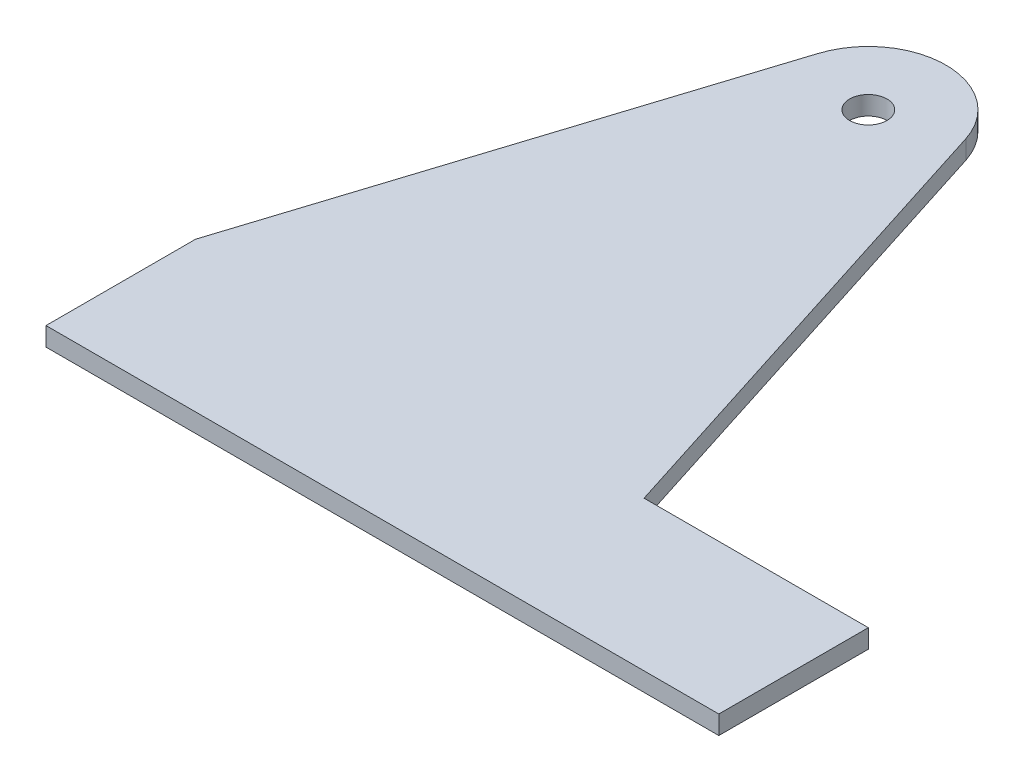
ISO-10303-21;
HEADER;
FILE_DESCRIPTION(('STEP AP214'),'2;1');
FILE_NAME('part.step','',(''),(''),'','','');
FILE_SCHEMA(('AUTOMOTIVE_DESIGN { 1 0 10303 214 1 1 1 1 }'));
ENDSEC;
DATA;
#1=APPLICATION_CONTEXT('core data for automotive mechanical design processes');
#2=APPLICATION_PROTOCOL_DEFINITION('international standard','automotive_design',2000,#1);
#3=PRODUCT_CONTEXT('',#1,'mechanical');
#4=PRODUCT('Part','Part','',(#3));
#5=PRODUCT_RELATED_PRODUCT_CATEGORY('part','',(#4));
#6=PRODUCT_DEFINITION_FORMATION('','',#4);
#7=PRODUCT_DEFINITION_CONTEXT('part definition',#1,'design');
#8=PRODUCT_DEFINITION('design','',#6,#7);
#9=PRODUCT_DEFINITION_SHAPE('','',#8);
#10=(LENGTH_UNIT() NAMED_UNIT(*) SI_UNIT(.MILLI.,.METRE.));
#11=(NAMED_UNIT(*) PLANE_ANGLE_UNIT() SI_UNIT($,.RADIAN.));
#12=(NAMED_UNIT(*) SI_UNIT($,.STERADIAN.) SOLID_ANGLE_UNIT());
#13=UNCERTAINTY_MEASURE_WITH_UNIT(LENGTH_MEASURE(1.E-05),#10,'distance_accuracy_value','');
#14=(GEOMETRIC_REPRESENTATION_CONTEXT(3) GLOBAL_UNCERTAINTY_ASSIGNED_CONTEXT((#13)) GLOBAL_UNIT_ASSIGNED_CONTEXT((#10,
#11,#12)) REPRESENTATION_CONTEXT('',''));
#15=CARTESIAN_POINT('',(0.,0.,0.));
#16=DIRECTION('',(0.,0.,1.));
#17=DIRECTION('',(1.,0.,0.));
#18=AXIS2_PLACEMENT_3D('',#15,#16,#17);
#19=CARTESIAN_POINT('',(0.,6.35,0.));
#20=DIRECTION('',(0.,-1.,0.));
#21=DIRECTION('',(0.,0.,-1.));
#22=AXIS2_PLACEMENT_3D('',#19,#20,#21);
#23=PLANE('',#22);
#24=DIRECTION('',(0.,0.,1.));
#25=VECTOR('',#24,1.);
#26=CARTESIAN_POINT('',(-76.2,6.35,203.2));
#27=LINE('',#26,#25);
#28=CARTESIAN_POINT('',(-76.2,6.35,152.4));
#29=VERTEX_POINT('',#28);
#30=CARTESIAN_POINT('',(-76.2,6.35,203.2));
#31=VERTEX_POINT('',#30);
#32=EDGE_CURVE('E147',#29,#31,#27,.T.);
#33=ORIENTED_EDGE('',*,*,#32,.T.);
#34=DIRECTION('',(1.,0.,0.));
#35=VECTOR('',#34,1.);
#36=CARTESIAN_POINT('',(-76.2,6.35,203.2));
#37=LINE('',#36,#35);
#38=CARTESIAN_POINT('',(152.4,6.35,203.2));
#39=VERTEX_POINT('',#38);
#40=EDGE_CURVE('E100',#31,#39,#37,.T.);
#41=ORIENTED_EDGE('',*,*,#40,.T.);
#42=DIRECTION('',(0.,0.,-1.));
#43=VECTOR('',#42,1.);
#44=CARTESIAN_POINT('',(152.4,6.35,152.4));
#45=LINE('',#44,#43);
#46=CARTESIAN_POINT('',(152.4,6.35,152.4));
#47=VERTEX_POINT('',#46);
#48=EDGE_CURVE('E159',#39,#47,#45,.T.);
#49=ORIENTED_EDGE('',*,*,#48,.T.);
#50=DIRECTION('',(-1.,0.,0.));
#51=VECTOR('',#50,1.);
#52=CARTESIAN_POINT('',(76.2,6.35,152.4));
#53=LINE('',#52,#51);
#54=CARTESIAN_POINT('',(76.2,6.35,152.4));
#55=VERTEX_POINT('',#54);
#56=EDGE_CURVE('E116',#47,#55,#53,.T.);
#57=ORIENTED_EDGE('',*,*,#56,.T.);
#58=DIRECTION('',(-0.303513333205354,0.,-0.952827191345091));
#59=VECTOR('',#58,1.);
#60=CARTESIAN_POINT('',(76.2,6.35,152.4));
#61=LINE('',#60,#59);
#62=CARTESIAN_POINT('',(25.1069964919431,6.35,-7.99757632996109));
#63=VERTEX_POINT('',#62);
#64=EDGE_CURVE('E110',#55,#63,#61,.T.);
#65=ORIENTED_EDGE('',*,*,#64,.T.);
#66=CARTESIAN_POINT('',(0.,6.35,0.));
#67=DIRECTION('',(0.,1.,0.));
#68=DIRECTION('',(0.,0.,-1.));
#69=AXIS2_PLACEMENT_3D('',#66,#67,#68);
#70=CIRCLE('',#69,26.35);
#71=CARTESIAN_POINT('',(-25.1069964919431,6.35,-7.99757632996108));
#72=VERTEX_POINT('',#71);
#73=EDGE_CURVE('E114',#63,#72,#70,.T.);
#74=ORIENTED_EDGE('',*,*,#73,.T.);
#75=DIRECTION('',(-0.303513333205354,0.,0.952827191345091));
#76=VECTOR('',#75,1.);
#77=CARTESIAN_POINT('',(-76.2,6.35,152.4));
#78=LINE('',#77,#76);
#79=EDGE_CURVE('E60',#72,#29,#78,.T.);
#80=ORIENTED_EDGE('',*,*,#79,.T.);
#81=EDGE_LOOP('',(#33,#41,#49,#57,#65,#74,#80));
#82=FACE_BOUND('',#81,.T.);
#83=CARTESIAN_POINT('',(0.,6.35,0.));
#84=DIRECTION('',(0.,1.,0.));
#85=DIRECTION('',(0.,0.,1.));
#86=AXIS2_PLACEMENT_3D('',#83,#84,#85);
#87=CIRCLE('',#86,6.35);
#88=CARTESIAN_POINT('',(0.,6.35,6.35));
#89=VERTEX_POINT('',#88);
#90=EDGE_CURVE('E138',#89,#89,#87,.T.);
#91=ORIENTED_EDGE('',*,*,#90,.F.);
#92=EDGE_LOOP('',(#91));
#93=FACE_BOUND('',#92,.T.);
#94=ADVANCED_FACE('F43',(#82,#93),#23,.F.);
#95=CARTESIAN_POINT('',(0.,0.,0.));
#96=DIRECTION('',(0.,-1.,0.));
#97=DIRECTION('',(0.,0.,-1.));
#98=AXIS2_PLACEMENT_3D('',#95,#96,#97);
#99=PLANE('',#98);
#100=DIRECTION('',(0.,0.,1.));
#101=VECTOR('',#100,1.);
#102=CARTESIAN_POINT('',(-76.2,0.,203.2));
#103=LINE('',#102,#101);
#104=CARTESIAN_POINT('',(-76.2,0.,152.4));
#105=VERTEX_POINT('',#104);
#106=CARTESIAN_POINT('',(-76.2,0.,203.2));
#107=VERTEX_POINT('',#106);
#108=EDGE_CURVE('E134',#105,#107,#103,.T.);
#109=ORIENTED_EDGE('',*,*,#108,.F.);
#110=DIRECTION('',(-0.303513333205354,0.,0.952827191345091));
#111=VECTOR('',#110,1.);
#112=CARTESIAN_POINT('',(-76.2,0.,152.4));
#113=LINE('',#112,#111);
#114=CARTESIAN_POINT('',(-25.1069964919431,0.,-7.99757632996108));
#115=VERTEX_POINT('',#114);
#116=EDGE_CURVE('E92',#115,#105,#113,.T.);
#117=ORIENTED_EDGE('',*,*,#116,.F.);
#118=CARTESIAN_POINT('',(0.,0.,0.));
#119=DIRECTION('',(0.,1.,0.));
#120=DIRECTION('',(0.,0.,-1.));
#121=AXIS2_PLACEMENT_3D('',#118,#119,#120);
#122=CIRCLE('',#121,26.35);
#123=CARTESIAN_POINT('',(25.1069964919431,0.,-7.99757632996109));
#124=VERTEX_POINT('',#123);
#125=EDGE_CURVE('E86',#124,#115,#122,.T.);
#126=ORIENTED_EDGE('',*,*,#125,.F.);
#127=DIRECTION('',(-0.303513333205354,0.,-0.952827191345091));
#128=VECTOR('',#127,1.);
#129=CARTESIAN_POINT('',(76.2,0.,152.4));
#130=LINE('',#129,#128);
#131=CARTESIAN_POINT('',(76.2,0.,152.4));
#132=VERTEX_POINT('',#131);
#133=EDGE_CURVE('E124',#132,#124,#130,.T.);
#134=ORIENTED_EDGE('',*,*,#133,.F.);
#135=DIRECTION('',(-1.,0.,0.));
#136=VECTOR('',#135,1.);
#137=CARTESIAN_POINT('',(76.2,0.,152.4));
#138=LINE('',#137,#136);
#139=CARTESIAN_POINT('',(152.4,0.,152.4));
#140=VERTEX_POINT('',#139);
#141=EDGE_CURVE('E142',#140,#132,#138,.T.);
#142=ORIENTED_EDGE('',*,*,#141,.F.);
#143=DIRECTION('',(0.,0.,-1.));
#144=VECTOR('',#143,1.);
#145=CARTESIAN_POINT('',(152.4,0.,152.4));
#146=LINE('',#145,#144);
#147=CARTESIAN_POINT('',(152.4,0.,203.2));
#148=VERTEX_POINT('',#147);
#149=EDGE_CURVE('E140',#148,#140,#146,.T.);
#150=ORIENTED_EDGE('',*,*,#149,.F.);
#151=DIRECTION('',(1.,0.,0.));
#152=VECTOR('',#151,1.);
#153=CARTESIAN_POINT('',(-76.2,0.,203.2));
#154=LINE('',#153,#152);
#155=EDGE_CURVE('E137',#107,#148,#154,.T.);
#156=ORIENTED_EDGE('',*,*,#155,.F.);
#157=EDGE_LOOP('',(#109,#117,#126,#134,#142,#150,#156));
#158=FACE_BOUND('',#157,.T.);
#159=CARTESIAN_POINT('',(0.,0.,0.));
#160=DIRECTION('',(0.,1.,0.));
#161=DIRECTION('',(0.,0.,1.));
#162=AXIS2_PLACEMENT_3D('',#159,#160,#161);
#163=CIRCLE('',#162,6.35);
#164=CARTESIAN_POINT('',(0.,0.,6.35));
#165=VERTEX_POINT('',#164);
#166=EDGE_CURVE('E171',#165,#165,#163,.T.);
#167=ORIENTED_EDGE('',*,*,#166,.T.);
#168=EDGE_LOOP('',(#167));
#169=FACE_BOUND('',#168,.T.);
#170=ADVANCED_FACE('F163',(#158,#169),#99,.T.);
#171=CARTESIAN_POINT('',(-76.2,6.35,203.2));
#172=DIRECTION('',(1.,0.,0.));
#173=DIRECTION('',(0.,0.,-1.));
#174=AXIS2_PLACEMENT_3D('',#171,#172,#173);
#175=PLANE('',#174);
#176=ORIENTED_EDGE('',*,*,#108,.T.);
#177=DIRECTION('',(0.,-1.,0.));
#178=VECTOR('',#177,1.);
#179=CARTESIAN_POINT('',(-76.2,6.35,203.2));
#180=LINE('',#179,#178);
#181=EDGE_CURVE('E11',#31,#107,#180,.T.);
#182=ORIENTED_EDGE('',*,*,#181,.F.);
#183=ORIENTED_EDGE('',*,*,#32,.F.);
#184=DIRECTION('',(0.,-1.,0.));
#185=VECTOR('',#184,1.);
#186=CARTESIAN_POINT('',(-76.2,6.35,152.4));
#187=LINE('',#186,#185);
#188=EDGE_CURVE('E130',#29,#105,#187,.T.);
#189=ORIENTED_EDGE('',*,*,#188,.T.);
#190=EDGE_LOOP('',(#176,#182,#183,#189));
#191=FACE_BOUND('',#190,.T.);
#192=ADVANCED_FACE('F45',(#191),#175,.F.);
#193=CARTESIAN_POINT('',(-76.2,6.35,203.2));
#194=DIRECTION('',(0.,0.,-1.));
#195=DIRECTION('',(-1.,0.,0.));
#196=AXIS2_PLACEMENT_3D('',#193,#194,#195);
#197=PLANE('',#196);
#198=ORIENTED_EDGE('',*,*,#155,.T.);
#199=DIRECTION('',(0.,-1.,0.));
#200=VECTOR('',#199,1.);
#201=CARTESIAN_POINT('',(152.4,6.35,203.2));
#202=LINE('',#201,#200);
#203=EDGE_CURVE('E52',#39,#148,#202,.T.);
#204=ORIENTED_EDGE('',*,*,#203,.F.);
#205=ORIENTED_EDGE('',*,*,#40,.F.);
#206=ORIENTED_EDGE('',*,*,#181,.T.);
#207=EDGE_LOOP('',(#198,#204,#205,#206));
#208=FACE_BOUND('',#207,.T.);
#209=ADVANCED_FACE('F197',(#208),#197,.F.);
#210=CARTESIAN_POINT('',(152.4,6.35,152.4));
#211=DIRECTION('',(-1.,0.,0.));
#212=DIRECTION('',(0.,0.,1.));
#213=AXIS2_PLACEMENT_3D('',#210,#211,#212);
#214=PLANE('',#213);
#215=ORIENTED_EDGE('',*,*,#149,.T.);
#216=DIRECTION('',(0.,-1.,0.));
#217=VECTOR('',#216,1.);
#218=CARTESIAN_POINT('',(152.4,6.35,152.4));
#219=LINE('',#218,#217);
#220=EDGE_CURVE('E151',#47,#140,#219,.T.);
#221=ORIENTED_EDGE('',*,*,#220,.F.);
#222=ORIENTED_EDGE('',*,*,#48,.F.);
#223=ORIENTED_EDGE('',*,*,#203,.T.);
#224=EDGE_LOOP('',(#215,#221,#222,#223));
#225=FACE_BOUND('',#224,.T.);
#226=ADVANCED_FACE('F157',(#225),#214,.F.);
#227=CARTESIAN_POINT('',(76.2,6.35,152.4));
#228=DIRECTION('',(0.,0.,1.));
#229=DIRECTION('',(1.,0.,0.));
#230=AXIS2_PLACEMENT_3D('',#227,#228,#229);
#231=PLANE('',#230);
#232=ORIENTED_EDGE('',*,*,#141,.T.);
#233=DIRECTION('',(0.,-1.,0.));
#234=VECTOR('',#233,1.);
#235=CARTESIAN_POINT('',(76.2,6.35,152.4));
#236=LINE('',#235,#234);
#237=EDGE_CURVE('E125',#55,#132,#236,.T.);
#238=ORIENTED_EDGE('',*,*,#237,.F.);
#239=ORIENTED_EDGE('',*,*,#56,.F.);
#240=ORIENTED_EDGE('',*,*,#220,.T.);
#241=EDGE_LOOP('',(#232,#238,#239,#240));
#242=FACE_BOUND('',#241,.T.);
#243=ADVANCED_FACE('F166',(#242),#231,.F.);
#244=CARTESIAN_POINT('',(76.2,6.35,152.4));
#245=DIRECTION('',(-0.952827191345091,0.,0.303513333205354));
#246=DIRECTION('',(0.303513333205354,0.,0.952827191345091));
#247=AXIS2_PLACEMENT_3D('',#244,#245,#246);
#248=PLANE('',#247);
#249=ORIENTED_EDGE('',*,*,#133,.T.);
#250=DIRECTION('',(0.,-1.,0.));
#251=VECTOR('',#250,1.);
#252=CARTESIAN_POINT('',(25.1069964919431,6.35,-7.99757632996109));
#253=LINE('',#252,#251);
#254=EDGE_CURVE('E121',#63,#124,#253,.T.);
#255=ORIENTED_EDGE('',*,*,#254,.F.);
#256=ORIENTED_EDGE('',*,*,#64,.F.);
#257=ORIENTED_EDGE('',*,*,#237,.T.);
#258=EDGE_LOOP('',(#249,#255,#256,#257));
#259=FACE_BOUND('',#258,.T.);
#260=ADVANCED_FACE('F122',(#259),#248,.F.);
#261=CARTESIAN_POINT('',(0.,6.35,0.));
#262=DIRECTION('',(0.,-1.,0.));
#263=DIRECTION('',(0.,0.,-1.));
#264=AXIS2_PLACEMENT_3D('',#261,#262,#263);
#265=CYLINDRICAL_SURFACE('',#264,26.35);
#266=ORIENTED_EDGE('',*,*,#125,.T.);
#267=DIRECTION('',(0.,-1.,0.));
#268=VECTOR('',#267,1.);
#269=CARTESIAN_POINT('',(-25.1069964919431,6.35,-7.99757632996108));
#270=LINE('',#269,#268);
#271=EDGE_CURVE('E126',#72,#115,#270,.T.);
#272=ORIENTED_EDGE('',*,*,#271,.F.);
#273=ORIENTED_EDGE('',*,*,#73,.F.);
#274=ORIENTED_EDGE('',*,*,#254,.T.);
#275=EDGE_LOOP('',(#266,#272,#273,#274));
#276=FACE_BOUND('',#275,.T.);
#277=ADVANCED_FACE('F128',(#276),#265,.T.);
#278=CARTESIAN_POINT('',(-76.2,6.35,152.4));
#279=DIRECTION('',(0.952827191345091,0.,0.303513333205354));
#280=DIRECTION('',(0.303513333205354,0.,-0.952827191345092));
#281=AXIS2_PLACEMENT_3D('',#278,#279,#280);
#282=PLANE('',#281);
#283=ORIENTED_EDGE('',*,*,#116,.T.);
#284=ORIENTED_EDGE('',*,*,#188,.F.);
#285=ORIENTED_EDGE('',*,*,#79,.F.);
#286=ORIENTED_EDGE('',*,*,#271,.T.);
#287=EDGE_LOOP('',(#283,#284,#285,#286));
#288=FACE_BOUND('',#287,.T.);
#289=ADVANCED_FACE('F187',(#288),#282,.F.);
#290=CARTESIAN_POINT('',(0.,6.35,0.));
#291=DIRECTION('',(0.,-1.,0.));
#292=DIRECTION('',(0.,0.,-1.));
#293=AXIS2_PLACEMENT_3D('',#290,#291,#292);
#294=CYLINDRICAL_SURFACE('',#293,6.35);
#295=ORIENTED_EDGE('',*,*,#90,.T.);
#296=EDGE_LOOP('',(#295));
#297=FACE_BOUND('',#296,.T.);
#298=ORIENTED_EDGE('',*,*,#166,.F.);
#299=EDGE_LOOP('',(#298));
#300=FACE_BOUND('',#299,.T.);
#301=ADVANCED_FACE('F177',(#297,#300),#294,.F.);
#302=CLOSED_SHELL('',(#94,#170,#192,#209,#226,#243,#260,#277,#289,#301));
#303=MANIFOLD_SOLID_BREP('B2',#302);
#304=ADVANCED_BREP_SHAPE_REPRESENTATION('',(#18,#303),#14);
#305=SHAPE_DEFINITION_REPRESENTATION(#9,#304);
ENDSEC;
END-ISO-10303-21;
